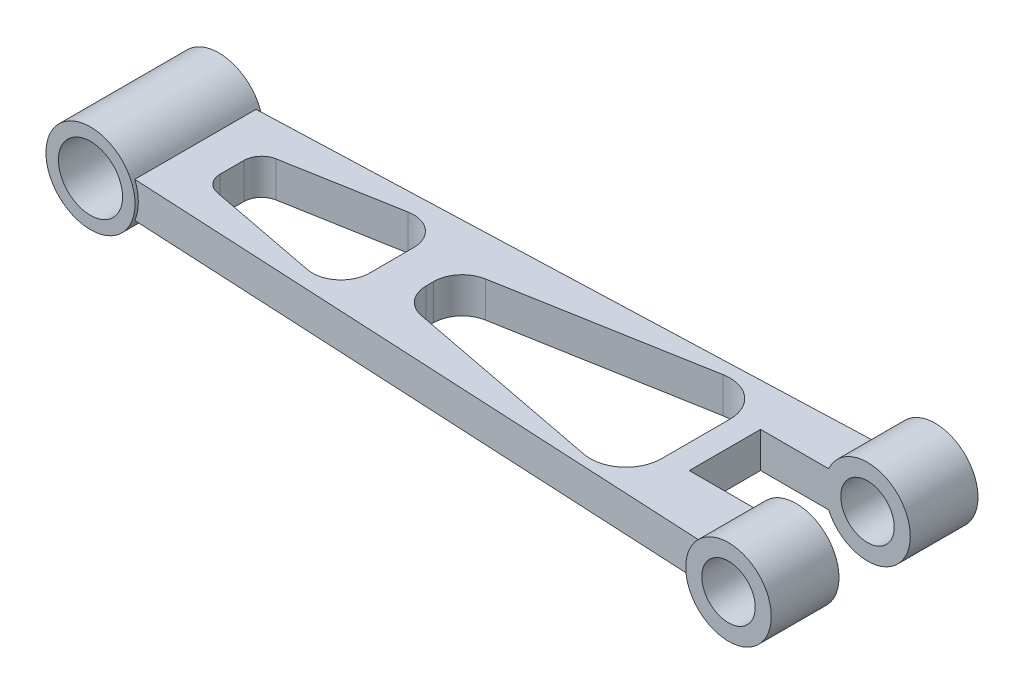
ISO-10303-21;
HEADER;
FILE_DESCRIPTION(('STEP AP214'),'2;1');
FILE_NAME('part.step','',(''),(''),'','','');
FILE_SCHEMA(('AUTOMOTIVE_DESIGN { 1 0 10303 214 1 1 1 1 }'));
ENDSEC;
DATA;
#1=APPLICATION_CONTEXT('core data for automotive mechanical design processes');
#2=APPLICATION_PROTOCOL_DEFINITION('international standard','automotive_design',2000,#1);
#3=PRODUCT_CONTEXT('',#1,'mechanical');
#4=PRODUCT('Part','Part','',(#3));
#5=PRODUCT_RELATED_PRODUCT_CATEGORY('part','',(#4));
#6=PRODUCT_DEFINITION_FORMATION('','',#4);
#7=PRODUCT_DEFINITION_CONTEXT('part definition',#1,'design');
#8=PRODUCT_DEFINITION('design','',#6,#7);
#9=PRODUCT_DEFINITION_SHAPE('','',#8);
#10=(LENGTH_UNIT() NAMED_UNIT(*) SI_UNIT(.MILLI.,.METRE.));
#11=(NAMED_UNIT(*) PLANE_ANGLE_UNIT() SI_UNIT($,.RADIAN.));
#12=(NAMED_UNIT(*) SI_UNIT($,.STERADIAN.) SOLID_ANGLE_UNIT());
#13=UNCERTAINTY_MEASURE_WITH_UNIT(LENGTH_MEASURE(1.E-05),#10,'distance_accuracy_value','');
#14=(GEOMETRIC_REPRESENTATION_CONTEXT(3) GLOBAL_UNCERTAINTY_ASSIGNED_CONTEXT((#13)) GLOBAL_UNIT_ASSIGNED_CONTEXT((#10,
#11,#12)) REPRESENTATION_CONTEXT('',''));
#15=CARTESIAN_POINT('',(0.,0.,0.));
#16=DIRECTION('',(0.,0.,1.));
#17=DIRECTION('',(1.,0.,0.));
#18=AXIS2_PLACEMENT_3D('',#15,#16,#17);
#19=CARTESIAN_POINT('',(95.,0.,29.));
#20=DIRECTION('',(0.,0.,-1.));
#21=DIRECTION('',(-1.,0.,0.));
#22=AXIS2_PLACEMENT_3D('',#19,#20,#21);
#23=CYLINDRICAL_SURFACE('',#22,12.);
#24=CARTESIAN_POINT('',(95.,0.,-29.));
#25=DIRECTION('',(0.,0.,1.));
#26=DIRECTION('',(1.,0.,0.));
#27=AXIS2_PLACEMENT_3D('',#24,#25,#26);
#28=CIRCLE('',#27,12.);
#29=CARTESIAN_POINT('',(107.,0.,-29.));
#30=VERTEX_POINT('',#29);
#31=EDGE_CURVE('E405',#30,#30,#28,.T.);
#32=ORIENTED_EDGE('',*,*,#31,.T.);
#33=EDGE_LOOP('',(#32));
#34=FACE_BOUND('',#33,.T.);
#35=CARTESIAN_POINT('',(95.,0.,-10.));
#36=DIRECTION('',(0.,0.,-1.));
#37=DIRECTION('',(-1.,0.,0.));
#38=AXIS2_PLACEMENT_3D('',#35,#36,#37);
#39=CIRCLE('',#38,12.);
#40=CARTESIAN_POINT('',(84.0912878853643,4.99999999999997,-10.));
#41=VERTEX_POINT('',#40);
#42=CARTESIAN_POINT('',(84.0912878853643,-5.,-10.));
#43=VERTEX_POINT('',#42);
#44=EDGE_CURVE('E360',#41,#43,#39,.T.);
#45=ORIENTED_EDGE('',*,*,#44,.T.);
#46=DIRECTION('',(0.,0.,-1.));
#47=VECTOR('',#46,1.);
#48=CARTESIAN_POINT('',(84.0912878853643,-5.,29.));
#49=LINE('',#48,#47);
#50=CARTESIAN_POINT('',(84.0912878853641,-5.,-23.1181290139471));
#51=VERTEX_POINT('',#50);
#52=EDGE_CURVE('E414',#43,#51,#49,.T.);
#53=ORIENTED_EDGE('',*,*,#52,.T.);
#54=CARTESIAN_POINT('',(95.,0.,-23.5170631291061));
#55=DIRECTION('',(0.0365458006997303,0.,0.999331979099646));
#56=DIRECTION('',(0.999331979099646,0.,-0.0365458006997303));
#57=AXIS2_PLACEMENT_3D('',#54,#55,#56);
#58=ELLIPSE('',#57,12.008021609407,12.);
#59=CARTESIAN_POINT('',(84.0912878853641,5.,-23.1181290139471));
#60=VERTEX_POINT('',#59);
#61=EDGE_CURVE('E409',#60,#51,#58,.T.);
#62=ORIENTED_EDGE('',*,*,#61,.F.);
#63=DIRECTION('',(0.,0.,-1.));
#64=VECTOR('',#63,1.);
#65=CARTESIAN_POINT('',(84.0912878853643,5.,29.));
#66=LINE('',#65,#64);
#67=EDGE_CURVE('E418',#41,#60,#66,.T.);
#68=ORIENTED_EDGE('',*,*,#67,.F.);
#69=EDGE_LOOP('',(#45,#53,#62,#68));
#70=FACE_BOUND('',#69,.T.);
#71=ADVANCED_FACE('F36',(#34,#70),#23,.T.);
#72=CARTESIAN_POINT('',(95.,0.,-29.));
#73=DIRECTION('',(0.,0.,1.));
#74=DIRECTION('',(1.,0.,0.));
#75=AXIS2_PLACEMENT_3D('',#72,#73,#74);
#76=CYLINDRICAL_SURFACE('',#75,7.50000000000001);
#77=CARTESIAN_POINT('',(95.,0.,-10.));
#78=DIRECTION('',(0.,0.,-1.));
#79=DIRECTION('',(-1.,0.,0.));
#80=AXIS2_PLACEMENT_3D('',#77,#78,#79);
#81=CIRCLE('',#80,7.50000000000001);
#82=CARTESIAN_POINT('',(87.5,0.,-10.));
#83=VERTEX_POINT('',#82);
#84=EDGE_CURVE('E356',#83,#83,#81,.F.);
#85=ORIENTED_EDGE('',*,*,#84,.T.);
#86=EDGE_LOOP('',(#85));
#87=FACE_BOUND('',#86,.T.);
#88=CARTESIAN_POINT('',(95.,0.,-29.));
#89=DIRECTION('',(0.,0.,1.));
#90=DIRECTION('',(1.,0.,0.));
#91=AXIS2_PLACEMENT_3D('',#88,#89,#90);
#92=CIRCLE('',#91,7.50000000000001);
#93=CARTESIAN_POINT('',(102.5,0.,-29.));
#94=VERTEX_POINT('',#93);
#95=EDGE_CURVE('E368',#94,#94,#92,.T.);
#96=ORIENTED_EDGE('',*,*,#95,.F.);
#97=EDGE_LOOP('',(#96));
#98=FACE_BOUND('',#97,.T.);
#99=ADVANCED_FACE('F471',(#87,#98),#76,.F.);
#100=CARTESIAN_POINT('',(95.,0.,29.));
#101=DIRECTION('',(0.,0.,1.));
#102=DIRECTION('',(1.,0.,0.));
#103=AXIS2_PLACEMENT_3D('',#100,#101,#102);
#104=CIRCLE('',#103,12.);
#105=CARTESIAN_POINT('',(107.,0.,29.));
#106=VERTEX_POINT('',#105);
#107=EDGE_CURVE('E406',#106,#106,#104,.T.);
#108=ORIENTED_EDGE('',*,*,#107,.F.);
#109=EDGE_LOOP('',(#108));
#110=FACE_BOUND('',#109,.T.);
#111=CARTESIAN_POINT('',(84.0912878853643,-5.,25.560781871242));
#112=VERTEX_POINT('',#111);
#113=CARTESIAN_POINT('',(84.0912878853643,-5.,10.));
#114=VERTEX_POINT('',#113);
#115=EDGE_CURVE('E415',#112,#114,#49,.T.);
#116=ORIENTED_EDGE('',*,*,#115,.T.);
#117=CARTESIAN_POINT('',(95.,0.,10.));
#118=DIRECTION('',(0.,0.,1.));
#119=DIRECTION('',(1.,0.,0.));
#120=AXIS2_PLACEMENT_3D('',#117,#118,#119);
#121=CIRCLE('',#120,12.);
#122=CARTESIAN_POINT('',(84.0912878853643,4.99999999999997,10.));
#123=VERTEX_POINT('',#122);
#124=EDGE_CURVE('E350',#114,#123,#121,.T.);
#125=ORIENTED_EDGE('',*,*,#124,.T.);
#126=CARTESIAN_POINT('',(84.0912878853643,5.,25.560781871242));
#127=VERTEX_POINT('',#126);
#128=EDGE_CURVE('E419',#127,#123,#66,.T.);
#129=ORIENTED_EDGE('',*,*,#128,.F.);
#130=CARTESIAN_POINT('',(95.,0.,26.1162363997815));
#131=DIRECTION('',(0.050852553448772,0.,-0.998706171908304));
#132=DIRECTION('',(-0.998706171908304,0.,-0.050852553448772));
#133=AXIS2_PLACEMENT_3D('',#130,#131,#132);
#134=ELLIPSE('',#133,12.0155460510179,12.);
#135=EDGE_CURVE('E422',#112,#127,#134,.T.);
#136=ORIENTED_EDGE('',*,*,#135,.F.);
#137=EDGE_LOOP('',(#116,#125,#129,#136));
#138=FACE_BOUND('',#137,.T.);
#139=ADVANCED_FACE('F474',(#110,#138),#23,.T.);
#140=CARTESIAN_POINT('',(95.,0.,29.));
#141=DIRECTION('',(0.,0.,1.));
#142=DIRECTION('',(1.,0.,0.));
#143=AXIS2_PLACEMENT_3D('',#140,#141,#142);
#144=PLANE('',#143);
#145=CARTESIAN_POINT('',(95.,0.,29.));
#146=DIRECTION('',(0.,0.,1.));
#147=DIRECTION('',(1.,0.,0.));
#148=AXIS2_PLACEMENT_3D('',#145,#146,#147);
#149=CIRCLE('',#148,7.50000000000001);
#150=CARTESIAN_POINT('',(102.5,0.,29.));
#151=VERTEX_POINT('',#150);
#152=EDGE_CURVE('E369',#151,#151,#149,.T.);
#153=ORIENTED_EDGE('',*,*,#152,.F.);
#154=EDGE_LOOP('',(#153));
#155=FACE_BOUND('',#154,.T.);
#156=ORIENTED_EDGE('',*,*,#107,.T.);
#157=EDGE_LOOP('',(#156));
#158=FACE_BOUND('',#157,.T.);
#159=ADVANCED_FACE('F484',(#155,#158),#144,.T.);
#160=CARTESIAN_POINT('',(95.,0.,-29.));
#161=DIRECTION('',(0.,0.,1.));
#162=DIRECTION('',(1.,0.,0.));
#163=AXIS2_PLACEMENT_3D('',#160,#161,#162);
#164=PLANE('',#163);
#165=ORIENTED_EDGE('',*,*,#95,.T.);
#166=EDGE_LOOP('',(#165));
#167=FACE_BOUND('',#166,.T.);
#168=ORIENTED_EDGE('',*,*,#31,.F.);
#169=EDGE_LOOP('',(#168));
#170=FACE_BOUND('',#169,.T.);
#171=ADVANCED_FACE('F38',(#167,#170),#164,.F.);
#172=CARTESIAN_POINT('',(0.,5.,0.));
#173=DIRECTION('',(0.,-1.,0.));
#174=DIRECTION('',(0.,0.,-1.));
#175=AXIS2_PLACEMENT_3D('',#172,#173,#174);
#176=PLANE('',#175);
#177=DIRECTION('',(-0.98190952454072,0.,-0.189350694786728));
#178=VECTOR('',#177,1.);
#179=CARTESIAN_POINT('',(-4.08125302438401,5.,21.1640164363641));
#180=LINE('',#179,#178);
#181=CARTESIAN_POINT('',(-37.3431881630948,4.99999999999999,14.7498098612605));
#182=VERTEX_POINT('',#181);
#183=CARTESIAN_POINT('',(-68.7751360787345,5.,8.6884966469799));
#184=VERTEX_POINT('',#183);
#185=EDGE_CURVE('E323',#182,#184,#180,.T.);
#186=ORIENTED_EDGE('',*,*,#185,.T.);
#187=CARTESIAN_POINT('',(-67.8283826048009,5.,3.77894902427629));
#188=DIRECTION('',(0.,-1.,0.));
#189=DIRECTION('',(0.,0.,-1.));
#190=AXIS2_PLACEMENT_3D('',#187,#188,#189);
#191=CIRCLE('',#190,5.);
#192=CARTESIAN_POINT('',(-72.8283826048009,4.99999999999999,3.77894902427626));
#193=VERTEX_POINT('',#192);
#194=EDGE_CURVE('E338',#184,#193,#191,.T.);
#195=ORIENTED_EDGE('',*,*,#194,.T.);
#196=DIRECTION('',(0.,0.,-1.));
#197=VECTOR('',#196,1.);
#198=CARTESIAN_POINT('',(-72.8283826048009,5.,0.));
#199=LINE('',#198,#197);
#200=CARTESIAN_POINT('',(-72.8283826048009,4.99999999999999,-2.84166329151157));
#201=VERTEX_POINT('',#200);
#202=EDGE_CURVE('E336',#193,#201,#199,.T.);
#203=ORIENTED_EDGE('',*,*,#202,.T.);
#204=CARTESIAN_POINT('',(-67.8283826048009,5.,-2.8416632915116));
#205=DIRECTION('',(0.,-1.,0.));
#206=DIRECTION('',(0.,0.,-1.));
#207=AXIS2_PLACEMENT_3D('',#204,#205,#206);
#208=CIRCLE('',#207,5.);
#209=CARTESIAN_POINT('',(-68.7047339542978,4.99999999999999,-7.76426507433284));
#210=VERTEX_POINT('',#209);
#211=EDGE_CURVE('E254',#201,#210,#208,.T.);
#212=ORIENTED_EDGE('',*,*,#211,.T.);
#213=DIRECTION('',(0.984520356564248,0.,-0.175270269899394));
#214=VECTOR('',#213,1.);
#215=CARTESIAN_POINT('',(-3.45036602580996,5.,-19.3812424203914));
#216=LINE('',#215,#214);
#217=CARTESIAN_POINT('',(-37.2305447639961,4.99999999999999,-13.3674906424664));
#218=VERTEX_POINT('',#217);
#219=EDGE_CURVE('E333',#210,#218,#216,.T.);
#220=ORIENTED_EDGE('',*,*,#219,.T.);
#221=CARTESIAN_POINT('',(-35.8283826048009,5.,-5.49132778995243));
#222=DIRECTION('',(0.,-1.,0.));
#223=DIRECTION('',(0.,0.,-1.));
#224=AXIS2_PLACEMENT_3D('',#221,#222,#223);
#225=CIRCLE('',#224,8.);
#226=CARTESIAN_POINT('',(-27.8283826048009,4.99999999999999,-5.49132778995236));
#227=VERTEX_POINT('',#226);
#228=EDGE_CURVE('E271',#218,#227,#225,.T.);
#229=ORIENTED_EDGE('',*,*,#228,.T.);
#230=DIRECTION('',(0.,0.,1.));
#231=VECTOR('',#230,1.);
#232=CARTESIAN_POINT('',(-27.8283826048009,5.,0.));
#233=LINE('',#232,#231);
#234=CARTESIAN_POINT('',(-27.8283826048009,4.99999999999999,6.89453366493466));
#235=VERTEX_POINT('',#234);
#236=EDGE_CURVE('E329',#227,#235,#233,.T.);
#237=ORIENTED_EDGE('',*,*,#236,.T.);
#238=CARTESIAN_POINT('',(-35.8283826048009,5.,6.89453366493473));
#239=DIRECTION('',(0.,-1.,0.));
#240=DIRECTION('',(0.,0.,-1.));
#241=AXIS2_PLACEMENT_3D('',#238,#239,#240);
#242=CIRCLE('',#241,8.);
#243=EDGE_CURVE('E326',#235,#182,#242,.T.);
#244=ORIENTED_EDGE('',*,*,#243,.T.);
#245=EDGE_LOOP('',(#186,#195,#203,#212,#220,#229,#237,#244));
#246=FACE_BOUND('',#245,.T.);
#247=DIRECTION('',(-0.98190952454072,0.,-0.189350694786728));
#248=VECTOR('',#247,1.);
#249=CARTESIAN_POINT('',(-2.21110408526903,5.,11.4660480307291));
#250=LINE('',#249,#248);
#251=CARTESIAN_POINT('',(46.3294695483435,4.99999999999999,20.8265757709708));
#252=VERTEX_POINT('',#251);
#253=CARTESIAN_POINT('',(-10.291829062083,5.,9.90776709903547));
#254=VERTEX_POINT('',#253);
#255=EDGE_CURVE('E302',#252,#254,#250,.T.);
#256=ORIENTED_EDGE('',*,*,#255,.T.);
#257=CARTESIAN_POINT('',(-8.77702350378922,5.,2.05249090270971));
#258=DIRECTION('',(0.,-1.,0.));
#259=DIRECTION('',(0.,0.,-1.));
#260=AXIS2_PLACEMENT_3D('',#257,#258,#259);
#261=CIRCLE('',#260,8.);
#262=CARTESIAN_POINT('',(-16.7770235037892,4.99999999999999,2.05249090270971));
#263=VERTEX_POINT('',#262);
#264=EDGE_CURVE('E211',#254,#263,#261,.T.);
#265=ORIENTED_EDGE('',*,*,#264,.T.);
#266=DIRECTION('',(0.,0.,-1.));
#267=VECTOR('',#266,1.);
#268=CARTESIAN_POINT('',(-16.7770235037892,5.,0.));
#269=LINE('',#268,#267);
#270=CARTESIAN_POINT('',(-16.7770235037892,4.99999999999999,-0.0800242868247675));
#271=VERTEX_POINT('',#270);
#272=EDGE_CURVE('E319',#263,#271,#269,.T.);
#273=ORIENTED_EDGE('',*,*,#272,.T.);
#274=CARTESIAN_POINT('',(-8.77702350378922,5.,-0.0800242868247685));
#275=DIRECTION('',(0.,-1.,0.));
#276=DIRECTION('',(0.,0.,-1.));
#277=AXIS2_PLACEMENT_3D('',#274,#275,#276);
#278=CIRCLE('',#277,8.);
#279=CARTESIAN_POINT('',(-10.1791856629844,4.99999999999999,-7.95618713933875));
#280=VERTEX_POINT('',#279);
#281=EDGE_CURVE('E316',#271,#280,#278,.T.);
#282=ORIENTED_EDGE('',*,*,#281,.T.);
#283=DIRECTION('',(0.984520356564248,0.,-0.175270269899394));
#284=VECTOR('',#283,1.);
#285=CARTESIAN_POINT('',(-1.68559816571888,5.,-9.46826696900827));
#286=LINE('',#285,#284);
#287=CARTESIAN_POINT('',(46.4702737972168,4.99999999999999,-18.0412666230115));
#288=VERTEX_POINT('',#287);
#289=EDGE_CURVE('E313',#280,#288,#286,.T.);
#290=ORIENTED_EDGE('',*,*,#289,.T.);
#291=CARTESIAN_POINT('',(48.2229764962108,5.,-8.19606305736897));
#292=DIRECTION('',(0.,-1.,0.));
#293=DIRECTION('',(0.,0.,-1.));
#294=AXIS2_PLACEMENT_3D('',#291,#292,#293);
#295=CIRCLE('',#294,10.);
#296=CARTESIAN_POINT('',(58.2229764962108,4.99999999999999,-8.19606305736897));
#297=VERTEX_POINT('',#296);
#298=EDGE_CURVE('E310',#288,#297,#295,.T.);
#299=ORIENTED_EDGE('',*,*,#298,.T.);
#300=DIRECTION('',(0.,0.,1.));
#301=VECTOR('',#300,1.);
#302=CARTESIAN_POINT('',(58.2229764962108,5.,0.));
#303=LINE('',#302,#301);
#304=CARTESIAN_POINT('',(58.2229764962108,4.99999999999999,11.0074805255636));
#305=VERTEX_POINT('',#304);
#306=EDGE_CURVE('E307',#297,#305,#303,.T.);
#307=ORIENTED_EDGE('',*,*,#306,.T.);
#308=CARTESIAN_POINT('',(48.2229764962108,5.,11.0074805255636));
#309=DIRECTION('',(0.,-1.,0.));
#310=DIRECTION('',(0.,0.,-1.));
#311=AXIS2_PLACEMENT_3D('',#308,#309,#310);
#312=CIRCLE('',#311,10.);
#313=EDGE_CURVE('E304',#305,#252,#312,.T.);
#314=ORIENTED_EDGE('',*,*,#313,.T.);
#315=EDGE_LOOP('',(#256,#265,#273,#282,#290,#299,#307,#314));
#316=FACE_BOUND('',#315,.T.);
#317=DIRECTION('',(0.,0.,-1.));
#318=VECTOR('',#317,1.);
#319=CARTESIAN_POINT('',(65.,5.,0.));
#320=LINE('',#319,#318);
#321=CARTESIAN_POINT('',(65.,4.99999999999999,10.));
#322=VERTEX_POINT('',#321);
#323=CARTESIAN_POINT('',(65.,4.99999999999999,-10.));
#324=VERTEX_POINT('',#323);
#325=EDGE_CURVE('E365',#322,#324,#320,.T.);
#326=ORIENTED_EDGE('',*,*,#325,.T.);
#327=DIRECTION('',(1.,0.,0.));
#328=VECTOR('',#327,1.);
#329=CARTESIAN_POINT('',(0.,5.,-10.));
#330=LINE('',#329,#328);
#331=EDGE_CURVE('E362',#324,#41,#330,.T.);
#332=ORIENTED_EDGE('',*,*,#331,.T.);
#333=ORIENTED_EDGE('',*,*,#67,.T.);
#334=DIRECTION('',(-0.999331979099646,0.,0.0365458006997303));
#335=VECTOR('',#334,1.);
#336=CARTESIAN_POINT('',(-86.,5.,-16.8978514306966));
#337=LINE('',#336,#335);
#338=CARTESIAN_POINT('',(-83.5435607626104,5.,-16.9876839795173));
#339=VERTEX_POINT('',#338);
#340=EDGE_CURVE('E382',#60,#339,#337,.T.);
#341=ORIENTED_EDGE('',*,*,#340,.T.);
#342=DIRECTION('',(0.,0.,-1.));
#343=VECTOR('',#342,1.);
#344=CARTESIAN_POINT('',(-83.5435607626104,5.,18.));
#345=LINE('',#344,#343);
#346=CARTESIAN_POINT('',(-83.5435607626104,5.,17.0250780370911));
#347=VERTEX_POINT('',#346);
#348=EDGE_CURVE('E403',#339,#347,#345,.F.);
#349=ORIENTED_EDGE('',*,*,#348,.T.);
#350=DIRECTION('',(0.998706171908304,0.,0.0508525534487719));
#351=VECTOR('',#350,1.);
#352=CARTESIAN_POINT('',(87.5,5.,25.7343481511717));
#353=LINE('',#352,#351);
#354=EDGE_CURVE('E379',#347,#127,#353,.T.);
#355=ORIENTED_EDGE('',*,*,#354,.T.);
#356=ORIENTED_EDGE('',*,*,#128,.T.);
#357=DIRECTION('',(-1.,0.,0.));
#358=VECTOR('',#357,1.);
#359=CARTESIAN_POINT('',(0.,5.,10.));
#360=LINE('',#359,#358);
#361=EDGE_CURVE('E353',#123,#322,#360,.T.);
#362=ORIENTED_EDGE('',*,*,#361,.T.);
#363=EDGE_LOOP('',(#326,#332,#333,#341,#349,#355,#356,#362));
#364=FACE_BOUND('',#363,.T.);
#365=ADVANCED_FACE('F455',(#246,#316,#364),#176,.F.);
#366=CARTESIAN_POINT('',(0.,-5.,0.));
#367=DIRECTION('',(0.,-1.,0.));
#368=DIRECTION('',(0.,0.,-1.));
#369=AXIS2_PLACEMENT_3D('',#366,#367,#368);
#370=PLANE('',#369);
#371=CARTESIAN_POINT('',(-67.8283826048009,-5.,3.77894902427629));
#372=DIRECTION('',(0.,-1.,0.));
#373=DIRECTION('',(0.,0.,-1.));
#374=AXIS2_PLACEMENT_3D('',#371,#372,#373);
#375=CIRCLE('',#374,5.);
#376=CARTESIAN_POINT('',(-68.7751360787345,-5.00000000000001,8.6884966469799));
#377=VERTEX_POINT('',#376);
#378=CARTESIAN_POINT('',(-72.8283826048009,-5.00000000000001,3.77894902427626));
#379=VERTEX_POINT('',#378);
#380=EDGE_CURVE('E11',#377,#379,#375,.T.);
#381=ORIENTED_EDGE('',*,*,#380,.F.);
#382=DIRECTION('',(-0.98190952454072,0.,-0.189350694786728));
#383=VECTOR('',#382,1.);
#384=CARTESIAN_POINT('',(-4.08125302438401,-5.,21.1640164363641));
#385=LINE('',#384,#383);
#386=CARTESIAN_POINT('',(-37.3431881630948,-5.,14.7498098612605));
#387=VERTEX_POINT('',#386);
#388=EDGE_CURVE('E219',#387,#377,#385,.T.);
#389=ORIENTED_EDGE('',*,*,#388,.F.);
#390=CARTESIAN_POINT('',(-35.8283826048009,-5.,6.89453366493473));
#391=DIRECTION('',(0.,-1.,0.));
#392=DIRECTION('',(0.,0.,-1.));
#393=AXIS2_PLACEMENT_3D('',#390,#391,#392);
#394=CIRCLE('',#393,8.);
#395=CARTESIAN_POINT('',(-27.8283826048009,-5.00000000000001,6.89453366493466));
#396=VERTEX_POINT('',#395);
#397=EDGE_CURVE('E221',#396,#387,#394,.T.);
#398=ORIENTED_EDGE('',*,*,#397,.F.);
#399=DIRECTION('',(0.,0.,1.));
#400=VECTOR('',#399,1.);
#401=CARTESIAN_POINT('',(-27.8283826048009,-5.,0.));
#402=LINE('',#401,#400);
#403=CARTESIAN_POINT('',(-27.8283826048009,-5.00000000000001,-5.49132778995236));
#404=VERTEX_POINT('',#403);
#405=EDGE_CURVE('E229',#404,#396,#402,.T.);
#406=ORIENTED_EDGE('',*,*,#405,.F.);
#407=CARTESIAN_POINT('',(-35.8283826048009,-5.,-5.49132778995243));
#408=DIRECTION('',(0.,-1.,0.));
#409=DIRECTION('',(0.,0.,-1.));
#410=AXIS2_PLACEMENT_3D('',#407,#408,#409);
#411=CIRCLE('',#410,8.);
#412=CARTESIAN_POINT('',(-37.2305447639961,-5.00000000000001,-13.3674906424664));
#413=VERTEX_POINT('',#412);
#414=EDGE_CURVE('E231',#413,#404,#411,.T.);
#415=ORIENTED_EDGE('',*,*,#414,.F.);
#416=DIRECTION('',(0.984520356564248,0.,-0.175270269899394));
#417=VECTOR('',#416,1.);
#418=CARTESIAN_POINT('',(-3.45036602580996,-5.,-19.3812424203914));
#419=LINE('',#418,#417);
#420=CARTESIAN_POINT('',(-68.7047339542978,-5.00000000000001,-7.76426507433284));
#421=VERTEX_POINT('',#420);
#422=EDGE_CURVE('E233',#421,#413,#419,.T.);
#423=ORIENTED_EDGE('',*,*,#422,.F.);
#424=CARTESIAN_POINT('',(-67.8283826048009,-5.,-2.8416632915116));
#425=DIRECTION('',(0.,-1.,0.));
#426=DIRECTION('',(0.,0.,-1.));
#427=AXIS2_PLACEMENT_3D('',#424,#425,#426);
#428=CIRCLE('',#427,5.);
#429=CARTESIAN_POINT('',(-72.8283826048009,-5.00000000000001,-2.84166329151157));
#430=VERTEX_POINT('',#429);
#431=EDGE_CURVE('E235',#430,#421,#428,.T.);
#432=ORIENTED_EDGE('',*,*,#431,.F.);
#433=DIRECTION('',(0.,0.,-1.));
#434=VECTOR('',#433,1.);
#435=CARTESIAN_POINT('',(-72.8283826048009,-5.,0.));
#436=LINE('',#435,#434);
#437=EDGE_CURVE('E44',#379,#430,#436,.T.);
#438=ORIENTED_EDGE('',*,*,#437,.F.);
#439=EDGE_LOOP('',(#381,#389,#398,#406,#415,#423,#432,#438));
#440=FACE_BOUND('',#439,.T.);
#441=CARTESIAN_POINT('',(-8.77702350378922,-5.,2.05249090270971));
#442=DIRECTION('',(0.,-1.,0.));
#443=DIRECTION('',(0.,0.,-1.));
#444=AXIS2_PLACEMENT_3D('',#441,#442,#443);
#445=CIRCLE('',#444,8.);
#446=CARTESIAN_POINT('',(-10.291829062083,-5.00000000000001,9.90776709903547));
#447=VERTEX_POINT('',#446);
#448=CARTESIAN_POINT('',(-16.7770235037892,-5.00000000000001,2.05249090270971));
#449=VERTEX_POINT('',#448);
#450=EDGE_CURVE('E208',#447,#449,#445,.T.);
#451=ORIENTED_EDGE('',*,*,#450,.F.);
#452=DIRECTION('',(-0.98190952454072,0.,-0.189350694786728));
#453=VECTOR('',#452,1.);
#454=CARTESIAN_POINT('',(-2.21110408526903,-5.,11.4660480307291));
#455=LINE('',#454,#453);
#456=CARTESIAN_POINT('',(46.3294695483435,-5.,20.8265757709708));
#457=VERTEX_POINT('',#456);
#458=EDGE_CURVE('E194',#457,#447,#455,.T.);
#459=ORIENTED_EDGE('',*,*,#458,.F.);
#460=CARTESIAN_POINT('',(48.2229764962108,-5.,11.0074805255636));
#461=DIRECTION('',(0.,-1.,0.));
#462=DIRECTION('',(0.,0.,-1.));
#463=AXIS2_PLACEMENT_3D('',#460,#461,#462);
#464=CIRCLE('',#463,10.);
#465=CARTESIAN_POINT('',(58.2229764962108,-5.00000000000001,11.0074805255636));
#466=VERTEX_POINT('',#465);
#467=EDGE_CURVE('E202',#466,#457,#464,.T.);
#468=ORIENTED_EDGE('',*,*,#467,.F.);
#469=DIRECTION('',(0.,0.,1.));
#470=VECTOR('',#469,1.);
#471=CARTESIAN_POINT('',(58.2229764962108,-5.,0.));
#472=LINE('',#471,#470);
#473=CARTESIAN_POINT('',(58.2229764962108,-5.00000000000001,-8.19606305736897));
#474=VERTEX_POINT('',#473);
#475=EDGE_CURVE('E433',#474,#466,#472,.T.);
#476=ORIENTED_EDGE('',*,*,#475,.F.);
#477=CARTESIAN_POINT('',(48.2229764962108,-5.,-8.19606305736897));
#478=DIRECTION('',(0.,-1.,0.));
#479=DIRECTION('',(0.,0.,-1.));
#480=AXIS2_PLACEMENT_3D('',#477,#478,#479);
#481=CIRCLE('',#480,10.);
#482=CARTESIAN_POINT('',(46.4702737972168,-5.00000000000001,-18.0412666230115));
#483=VERTEX_POINT('',#482);
#484=EDGE_CURVE('E435',#483,#474,#481,.T.);
#485=ORIENTED_EDGE('',*,*,#484,.F.);
#486=DIRECTION('',(0.984520356564248,0.,-0.175270269899394));
#487=VECTOR('',#486,1.);
#488=CARTESIAN_POINT('',(-1.68559816571888,-5.,-9.46826696900827));
#489=LINE('',#488,#487);
#490=CARTESIAN_POINT('',(-10.1791856629844,-5.00000000000001,-7.95618713933875));
#491=VERTEX_POINT('',#490);
#492=EDGE_CURVE('E437',#491,#483,#489,.T.);
#493=ORIENTED_EDGE('',*,*,#492,.F.);
#494=CARTESIAN_POINT('',(-8.77702350378922,-5.,-0.0800242868247685));
#495=DIRECTION('',(0.,-1.,0.));
#496=DIRECTION('',(0.,0.,-1.));
#497=AXIS2_PLACEMENT_3D('',#494,#495,#496);
#498=CIRCLE('',#497,8.);
#499=CARTESIAN_POINT('',(-16.7770235037892,-5.00000000000001,-0.0800242868247675));
#500=VERTEX_POINT('',#499);
#501=EDGE_CURVE('E223',#500,#491,#498,.T.);
#502=ORIENTED_EDGE('',*,*,#501,.F.);
#503=DIRECTION('',(0.,0.,-1.));
#504=VECTOR('',#503,1.);
#505=CARTESIAN_POINT('',(-16.7770235037892,-5.,0.));
#506=LINE('',#505,#504);
#507=EDGE_CURVE('E218',#449,#500,#506,.T.);
#508=ORIENTED_EDGE('',*,*,#507,.F.);
#509=EDGE_LOOP('',(#451,#459,#468,#476,#485,#493,#502,#508));
#510=FACE_BOUND('',#509,.T.);
#511=DIRECTION('',(1.,0.,0.));
#512=VECTOR('',#511,1.);
#513=CARTESIAN_POINT('',(0.,-5.,-10.));
#514=LINE('',#513,#512);
#515=CARTESIAN_POINT('',(65.,-5.00000000000001,-10.));
#516=VERTEX_POINT('',#515);
#517=EDGE_CURVE('E357',#516,#43,#514,.T.);
#518=ORIENTED_EDGE('',*,*,#517,.F.);
#519=DIRECTION('',(0.,0.,-1.));
#520=VECTOR('',#519,1.);
#521=CARTESIAN_POINT('',(65.,-5.,0.));
#522=LINE('',#521,#520);
#523=CARTESIAN_POINT('',(65.,-5.00000000000001,10.));
#524=VERTEX_POINT('',#523);
#525=EDGE_CURVE('E203',#524,#516,#522,.T.);
#526=ORIENTED_EDGE('',*,*,#525,.F.);
#527=DIRECTION('',(-1.,0.,0.));
#528=VECTOR('',#527,1.);
#529=CARTESIAN_POINT('',(0.,-5.,10.));
#530=LINE('',#529,#528);
#531=EDGE_CURVE('E348',#114,#524,#530,.T.);
#532=ORIENTED_EDGE('',*,*,#531,.F.);
#533=ORIENTED_EDGE('',*,*,#115,.F.);
#534=DIRECTION('',(0.998706171908304,0.,0.0508525534487719));
#535=VECTOR('',#534,1.);
#536=CARTESIAN_POINT('',(87.5,-5.,25.7343481511717));
#537=LINE('',#536,#535);
#538=CARTESIAN_POINT('',(-83.5435607626104,-5.,17.0250780370911));
#539=VERTEX_POINT('',#538);
#540=EDGE_CURVE('E378',#539,#112,#537,.T.);
#541=ORIENTED_EDGE('',*,*,#540,.F.);
#542=DIRECTION('',(0.,0.,-1.));
#543=VECTOR('',#542,1.);
#544=CARTESIAN_POINT('',(-83.5435607626104,-5.,18.));
#545=LINE('',#544,#543);
#546=CARTESIAN_POINT('',(-83.5435607626104,-5.,-16.9876839795173));
#547=VERTEX_POINT('',#546);
#548=EDGE_CURVE('E392',#547,#539,#545,.F.);
#549=ORIENTED_EDGE('',*,*,#548,.F.);
#550=DIRECTION('',(-0.999331979099646,0.,0.0365458006997303));
#551=VECTOR('',#550,1.);
#552=CARTESIAN_POINT('',(-86.,-5.,-16.8978514306966));
#553=LINE('',#552,#551);
#554=EDGE_CURVE('E383',#51,#547,#553,.T.);
#555=ORIENTED_EDGE('',*,*,#554,.F.);
#556=ORIENTED_EDGE('',*,*,#52,.F.);
#557=EDGE_LOOP('',(#518,#526,#532,#533,#541,#549,#555,#556));
#558=FACE_BOUND('',#557,.T.);
#559=ADVANCED_FACE('F215',(#440,#510,#558),#370,.T.);
#560=CARTESIAN_POINT('',(-95.,0.,18.));
#561=DIRECTION('',(0.,0.,-1.));
#562=DIRECTION('',(-1.,0.,0.));
#563=AXIS2_PLACEMENT_3D('',#560,#561,#562);
#564=CYLINDRICAL_SURFACE('',#563,12.5);
#565=CARTESIAN_POINT('',(-95.,0.,-18.));
#566=DIRECTION('',(0.,0.,1.));
#567=DIRECTION('',(1.,0.,0.));
#568=AXIS2_PLACEMENT_3D('',#565,#566,#567);
#569=CIRCLE('',#568,12.5);
#570=CARTESIAN_POINT('',(-82.5,0.,-18.));
#571=VERTEX_POINT('',#570);
#572=EDGE_CURVE('E385',#571,#571,#569,.T.);
#573=ORIENTED_EDGE('',*,*,#572,.T.);
#574=EDGE_LOOP('',(#573));
#575=FACE_BOUND('',#574,.T.);
#576=CARTESIAN_POINT('',(-95.,0.,18.));
#577=DIRECTION('',(0.,0.,1.));
#578=DIRECTION('',(1.,0.,0.));
#579=AXIS2_PLACEMENT_3D('',#576,#577,#578);
#580=CIRCLE('',#579,12.5);
#581=CARTESIAN_POINT('',(-82.5,0.,18.));
#582=VERTEX_POINT('',#581);
#583=EDGE_CURVE('E389',#582,#582,#580,.T.);
#584=ORIENTED_EDGE('',*,*,#583,.F.);
#585=EDGE_LOOP('',(#584));
#586=FACE_BOUND('',#585,.T.);
#587=ORIENTED_EDGE('',*,*,#348,.F.);
#588=CARTESIAN_POINT('',(-95.,0.,-16.568719357295));
#589=DIRECTION('',(0.0365458006997303,0.,0.999331979099646));
#590=DIRECTION('',(0.999331979099646,0.,-0.0365458006997303));
#591=AXIS2_PLACEMENT_3D('',#588,#589,#590);
#592=ELLIPSE('',#591,12.5083558431323,12.5);
#593=EDGE_CURVE('E397',#547,#339,#592,.T.);
#594=ORIENTED_EDGE('',*,*,#593,.F.);
#595=ORIENTED_EDGE('',*,*,#548,.T.);
#596=CARTESIAN_POINT('',(-95.,0.,16.4417341016683));
#597=DIRECTION('',(0.050852553448772,0.,-0.998706171908304));
#598=DIRECTION('',(-0.998706171908304,0.,-0.050852553448772));
#599=AXIS2_PLACEMENT_3D('',#596,#597,#598);
#600=ELLIPSE('',#599,12.5161938031436,12.5);
#601=EDGE_CURVE('E400',#347,#539,#600,.T.);
#602=ORIENTED_EDGE('',*,*,#601,.F.);
#603=EDGE_LOOP('',(#587,#594,#595,#602));
#604=FACE_BOUND('',#603,.T.);
#605=ADVANCED_FACE('F504',(#575,#586,#604),#564,.T.);
#606=CARTESIAN_POINT('',(-95.,0.,18.));
#607=DIRECTION('',(0.,0.,1.));
#608=DIRECTION('',(1.,0.,0.));
#609=AXIS2_PLACEMENT_3D('',#606,#607,#608);
#610=PLANE('',#609);
#611=CARTESIAN_POINT('',(-95.,0.,18.));
#612=DIRECTION('',(0.,0.,1.));
#613=DIRECTION('',(1.,0.,0.));
#614=AXIS2_PLACEMENT_3D('',#611,#612,#613);
#615=CIRCLE('',#614,9.);
#616=CARTESIAN_POINT('',(-86.,0.,18.));
#617=VERTEX_POINT('',#616);
#618=EDGE_CURVE('E375',#617,#617,#615,.T.);
#619=ORIENTED_EDGE('',*,*,#618,.F.);
#620=EDGE_LOOP('',(#619));
#621=FACE_BOUND('',#620,.T.);
#622=ORIENTED_EDGE('',*,*,#583,.T.);
#623=EDGE_LOOP('',(#622));
#624=FACE_BOUND('',#623,.T.);
#625=ADVANCED_FACE('F539',(#621,#624),#610,.T.);
#626=CARTESIAN_POINT('',(-95.,0.,-18.));
#627=DIRECTION('',(0.,0.,1.));
#628=DIRECTION('',(1.,0.,0.));
#629=AXIS2_PLACEMENT_3D('',#626,#627,#628);
#630=PLANE('',#629);
#631=CARTESIAN_POINT('',(-95.,0.,-18.));
#632=DIRECTION('',(0.,0.,1.));
#633=DIRECTION('',(1.,0.,0.));
#634=AXIS2_PLACEMENT_3D('',#631,#632,#633);
#635=CIRCLE('',#634,9.);
#636=CARTESIAN_POINT('',(-86.,0.,-18.));
#637=VERTEX_POINT('',#636);
#638=EDGE_CURVE('E372',#637,#637,#635,.T.);
#639=ORIENTED_EDGE('',*,*,#638,.T.);
#640=EDGE_LOOP('',(#639));
#641=FACE_BOUND('',#640,.T.);
#642=ORIENTED_EDGE('',*,*,#572,.F.);
#643=EDGE_LOOP('',(#642));
#644=FACE_BOUND('',#643,.T.);
#645=ADVANCED_FACE('F536',(#641,#644),#630,.F.);
#646=CARTESIAN_POINT('',(87.5,5.,25.7343481511717));
#647=DIRECTION('',(0.050852553448772,0.,-0.998706171908304));
#648=DIRECTION('',(-0.998706171908304,0.,-0.050852553448772));
#649=AXIS2_PLACEMENT_3D('',#646,#647,#648);
#650=PLANE('',#649);
#651=ORIENTED_EDGE('',*,*,#540,.T.);
#652=ORIENTED_EDGE('',*,*,#135,.T.);
#653=ORIENTED_EDGE('',*,*,#354,.F.);
#654=ORIENTED_EDGE('',*,*,#601,.T.);
#655=EDGE_LOOP('',(#651,#652,#653,#654));
#656=FACE_BOUND('',#655,.T.);
#657=ADVANCED_FACE('F498',(#656),#650,.F.);
#658=CARTESIAN_POINT('',(-86.,5.,-16.8978514306966));
#659=DIRECTION('',(0.0365458006997303,0.,0.999331979099646));
#660=DIRECTION('',(0.999331979099646,0.,-0.0365458006997303));
#661=AXIS2_PLACEMENT_3D('',#658,#659,#660);
#662=PLANE('',#661);
#663=ORIENTED_EDGE('',*,*,#340,.F.);
#664=ORIENTED_EDGE('',*,*,#61,.T.);
#665=ORIENTED_EDGE('',*,*,#554,.T.);
#666=ORIENTED_EDGE('',*,*,#593,.T.);
#667=EDGE_LOOP('',(#663,#664,#665,#666));
#668=FACE_BOUND('',#667,.T.);
#669=ADVANCED_FACE('F509',(#668),#662,.F.);
#670=CARTESIAN_POINT('',(-95.,0.,-29.));
#671=DIRECTION('',(0.,0.,1.));
#672=DIRECTION('',(1.,0.,0.));
#673=AXIS2_PLACEMENT_3D('',#670,#671,#672);
#674=CYLINDRICAL_SURFACE('',#673,9.);
#675=ORIENTED_EDGE('',*,*,#618,.T.);
#676=EDGE_LOOP('',(#675));
#677=FACE_BOUND('',#676,.T.);
#678=ORIENTED_EDGE('',*,*,#638,.F.);
#679=EDGE_LOOP('',(#678));
#680=FACE_BOUND('',#679,.T.);
#681=ADVANCED_FACE('F533',(#677,#680),#674,.F.);
#682=CARTESIAN_POINT('',(95.,0.,9.99999999999999));
#683=DIRECTION('',(0.,0.,1.));
#684=DIRECTION('',(1.,0.,0.));
#685=AXIS2_PLACEMENT_3D('',#682,#683,#684);
#686=CIRCLE('',#685,7.50000000000001);
#687=CARTESIAN_POINT('',(102.5,0.,9.99999999999999));
#688=VERTEX_POINT('',#687);
#689=EDGE_CURVE('E345',#688,#688,#686,.F.);
#690=ORIENTED_EDGE('',*,*,#689,.T.);
#691=EDGE_LOOP('',(#690));
#692=FACE_BOUND('',#691,.T.);
#693=ORIENTED_EDGE('',*,*,#152,.T.);
#694=EDGE_LOOP('',(#693));
#695=FACE_BOUND('',#694,.T.);
#696=ADVANCED_FACE('F480',(#692,#695),#76,.F.);
#697=CARTESIAN_POINT('',(65.,-24.,-10.));
#698=DIRECTION('',(-1.,0.,0.));
#699=DIRECTION('',(0.,0.,1.));
#700=AXIS2_PLACEMENT_3D('',#697,#698,#699);
#701=PLANE('',#700);
#702=DIRECTION('',(0.,1.,0.));
#703=VECTOR('',#702,1.);
#704=CARTESIAN_POINT('',(65.,-24.,10.));
#705=LINE('',#704,#703);
#706=EDGE_CURVE('E341',#524,#322,#705,.T.);
#707=ORIENTED_EDGE('',*,*,#706,.F.);
#708=ORIENTED_EDGE('',*,*,#525,.T.);
#709=DIRECTION('',(0.,1.,0.));
#710=VECTOR('',#709,1.);
#711=CARTESIAN_POINT('',(65.,-24.,-10.));
#712=LINE('',#711,#710);
#713=EDGE_CURVE('E342',#516,#324,#712,.T.);
#714=ORIENTED_EDGE('',*,*,#713,.T.);
#715=ORIENTED_EDGE('',*,*,#325,.F.);
#716=EDGE_LOOP('',(#707,#708,#714,#715));
#717=FACE_BOUND('',#716,.T.);
#718=ADVANCED_FACE('F517',(#717),#701,.F.);
#719=CARTESIAN_POINT('',(65.,-24.,-10.));
#720=DIRECTION('',(0.,0.,-1.));
#721=DIRECTION('',(-1.,0.,0.));
#722=AXIS2_PLACEMENT_3D('',#719,#720,#721);
#723=PLANE('',#722);
#724=ORIENTED_EDGE('',*,*,#84,.F.);
#725=EDGE_LOOP('',(#724));
#726=FACE_BOUND('',#725,.T.);
#727=ORIENTED_EDGE('',*,*,#713,.F.);
#728=ORIENTED_EDGE('',*,*,#517,.T.);
#729=ORIENTED_EDGE('',*,*,#44,.F.);
#730=ORIENTED_EDGE('',*,*,#331,.F.);
#731=EDGE_LOOP('',(#727,#728,#729,#730));
#732=FACE_BOUND('',#731,.T.);
#733=ADVANCED_FACE('F514',(#726,#732),#723,.F.);
#734=CARTESIAN_POINT('',(65.,-24.,10.));
#735=DIRECTION('',(0.,0.,1.));
#736=DIRECTION('',(1.,0.,0.));
#737=AXIS2_PLACEMENT_3D('',#734,#735,#736);
#738=PLANE('',#737);
#739=ORIENTED_EDGE('',*,*,#689,.F.);
#740=EDGE_LOOP('',(#739));
#741=FACE_BOUND('',#740,.T.);
#742=ORIENTED_EDGE('',*,*,#124,.F.);
#743=ORIENTED_EDGE('',*,*,#531,.T.);
#744=ORIENTED_EDGE('',*,*,#706,.T.);
#745=ORIENTED_EDGE('',*,*,#361,.F.);
#746=EDGE_LOOP('',(#742,#743,#744,#745));
#747=FACE_BOUND('',#746,.T.);
#748=ADVANCED_FACE('F519',(#741,#747),#738,.F.);
#749=CARTESIAN_POINT('',(-8.77702350378922,-24.,2.05249090270971));
#750=DIRECTION('',(0.,1.,0.));
#751=DIRECTION('',(0.,0.,1.));
#752=AXIS2_PLACEMENT_3D('',#749,#750,#751);
#753=CYLINDRICAL_SURFACE('',#752,8.);
#754=DIRECTION('',(0.,1.,0.));
#755=VECTOR('',#754,1.);
#756=CARTESIAN_POINT('',(-10.291829062083,-24.,9.90776709903547));
#757=LINE('',#756,#755);
#758=EDGE_CURVE('E59',#447,#254,#757,.T.);
#759=ORIENTED_EDGE('',*,*,#758,.F.);
#760=ORIENTED_EDGE('',*,*,#450,.T.);
#761=DIRECTION('',(0.,1.,0.));
#762=VECTOR('',#761,1.);
#763=CARTESIAN_POINT('',(-16.7770235037892,-24.,2.05249090270971));
#764=LINE('',#763,#762);
#765=EDGE_CURVE('E300',#449,#263,#764,.T.);
#766=ORIENTED_EDGE('',*,*,#765,.T.);
#767=ORIENTED_EDGE('',*,*,#264,.F.);
#768=EDGE_LOOP('',(#759,#760,#766,#767));
#769=FACE_BOUND('',#768,.T.);
#770=ADVANCED_FACE('F206',(#769),#753,.F.);
#771=CARTESIAN_POINT('',(-16.7770235037892,-24.,-0.0800242868247675));
#772=DIRECTION('',(-1.,0.,0.));
#773=DIRECTION('',(0.,0.,1.));
#774=AXIS2_PLACEMENT_3D('',#771,#772,#773);
#775=PLANE('',#774);
#776=ORIENTED_EDGE('',*,*,#765,.F.);
#777=ORIENTED_EDGE('',*,*,#507,.T.);
#778=DIRECTION('',(0.,1.,0.));
#779=VECTOR('',#778,1.);
#780=CARTESIAN_POINT('',(-16.7770235037892,-24.,-0.0800242868247675));
#781=LINE('',#780,#779);
#782=EDGE_CURVE('E297',#500,#271,#781,.T.);
#783=ORIENTED_EDGE('',*,*,#782,.T.);
#784=ORIENTED_EDGE('',*,*,#272,.F.);
#785=EDGE_LOOP('',(#776,#777,#783,#784));
#786=FACE_BOUND('',#785,.T.);
#787=ADVANCED_FACE('F458',(#786),#775,.F.);
#788=CARTESIAN_POINT('',(-8.77702350378922,-24.,-0.0800242868247685));
#789=DIRECTION('',(0.,1.,0.));
#790=DIRECTION('',(0.,0.,1.));
#791=AXIS2_PLACEMENT_3D('',#788,#789,#790);
#792=CYLINDRICAL_SURFACE('',#791,8.);
#793=ORIENTED_EDGE('',*,*,#782,.F.);
#794=ORIENTED_EDGE('',*,*,#501,.T.);
#795=DIRECTION('',(0.,1.,0.));
#796=VECTOR('',#795,1.);
#797=CARTESIAN_POINT('',(-10.1791856629844,-24.,-7.95618713933875));
#798=LINE('',#797,#796);
#799=EDGE_CURVE('E294',#491,#280,#798,.T.);
#800=ORIENTED_EDGE('',*,*,#799,.T.);
#801=ORIENTED_EDGE('',*,*,#281,.F.);
#802=EDGE_LOOP('',(#793,#794,#800,#801));
#803=FACE_BOUND('',#802,.T.);
#804=ADVANCED_FACE('F441',(#803),#792,.F.);
#805=CARTESIAN_POINT('',(46.4702737972168,-24.,-18.0412666230115));
#806=DIRECTION('',(-0.175270269899394,0.,-0.984520356564248));
#807=DIRECTION('',(-0.984520356564248,0.,0.175270269899394));
#808=AXIS2_PLACEMENT_3D('',#805,#806,#807);
#809=PLANE('',#808);
#810=ORIENTED_EDGE('',*,*,#799,.F.);
#811=ORIENTED_EDGE('',*,*,#492,.T.);
#812=DIRECTION('',(0.,1.,0.));
#813=VECTOR('',#812,1.);
#814=CARTESIAN_POINT('',(46.4702737972168,-24.,-18.0412666230115));
#815=LINE('',#814,#813);
#816=EDGE_CURVE('E291',#483,#288,#815,.T.);
#817=ORIENTED_EDGE('',*,*,#816,.T.);
#818=ORIENTED_EDGE('',*,*,#289,.F.);
#819=EDGE_LOOP('',(#810,#811,#817,#818));
#820=FACE_BOUND('',#819,.T.);
#821=ADVANCED_FACE('F444',(#820),#809,.F.);
#822=CARTESIAN_POINT('',(48.2229764962108,-24.,-8.19606305736897));
#823=DIRECTION('',(0.,1.,0.));
#824=DIRECTION('',(0.,0.,1.));
#825=AXIS2_PLACEMENT_3D('',#822,#823,#824);
#826=CYLINDRICAL_SURFACE('',#825,10.);
#827=ORIENTED_EDGE('',*,*,#816,.F.);
#828=ORIENTED_EDGE('',*,*,#484,.T.);
#829=DIRECTION('',(0.,1.,0.));
#830=VECTOR('',#829,1.);
#831=CARTESIAN_POINT('',(58.2229764962108,-24.,-8.19606305736897));
#832=LINE('',#831,#830);
#833=EDGE_CURVE('E288',#474,#297,#832,.T.);
#834=ORIENTED_EDGE('',*,*,#833,.T.);
#835=ORIENTED_EDGE('',*,*,#298,.F.);
#836=EDGE_LOOP('',(#827,#828,#834,#835));
#837=FACE_BOUND('',#836,.T.);
#838=ADVANCED_FACE('F450',(#837),#826,.F.);
#839=CARTESIAN_POINT('',(58.2229764962108,-24.,11.0074805255636));
#840=DIRECTION('',(1.,0.,0.));
#841=DIRECTION('',(0.,0.,-1.));
#842=AXIS2_PLACEMENT_3D('',#839,#840,#841);
#843=PLANE('',#842);
#844=ORIENTED_EDGE('',*,*,#833,.F.);
#845=ORIENTED_EDGE('',*,*,#475,.T.);
#846=DIRECTION('',(0.,1.,0.));
#847=VECTOR('',#846,1.);
#848=CARTESIAN_POINT('',(58.2229764962108,-24.,11.0074805255636));
#849=LINE('',#848,#847);
#850=EDGE_CURVE('E285',#466,#305,#849,.T.);
#851=ORIENTED_EDGE('',*,*,#850,.T.);
#852=ORIENTED_EDGE('',*,*,#306,.F.);
#853=EDGE_LOOP('',(#844,#845,#851,#852));
#854=FACE_BOUND('',#853,.T.);
#855=ADVANCED_FACE('F452',(#854),#843,.F.);
#856=CARTESIAN_POINT('',(48.2229764962108,-24.,11.0074805255636));
#857=DIRECTION('',(0.,1.,0.));
#858=DIRECTION('',(0.,0.,1.));
#859=AXIS2_PLACEMENT_3D('',#856,#857,#858);
#860=CYLINDRICAL_SURFACE('',#859,10.);
#861=ORIENTED_EDGE('',*,*,#850,.F.);
#862=ORIENTED_EDGE('',*,*,#467,.T.);
#863=DIRECTION('',(0.,1.,0.));
#864=VECTOR('',#863,1.);
#865=CARTESIAN_POINT('',(46.3294695483435,-24.,20.8265757709708));
#866=LINE('',#865,#864);
#867=EDGE_CURVE('E197',#457,#252,#866,.T.);
#868=ORIENTED_EDGE('',*,*,#867,.T.);
#869=ORIENTED_EDGE('',*,*,#313,.F.);
#870=EDGE_LOOP('',(#861,#862,#868,#869));
#871=FACE_BOUND('',#870,.T.);
#872=ADVANCED_FACE('F460',(#871),#860,.F.);
#873=CARTESIAN_POINT('',(-10.291829062083,-24.,9.90776709903547));
#874=DIRECTION('',(-0.189350694786728,0.,0.98190952454072));
#875=DIRECTION('',(0.98190952454072,0.,0.189350694786728));
#876=AXIS2_PLACEMENT_3D('',#873,#874,#875);
#877=PLANE('',#876);
#878=ORIENTED_EDGE('',*,*,#867,.F.);
#879=ORIENTED_EDGE('',*,*,#458,.T.);
#880=ORIENTED_EDGE('',*,*,#758,.T.);
#881=ORIENTED_EDGE('',*,*,#255,.F.);
#882=EDGE_LOOP('',(#878,#879,#880,#881));
#883=FACE_BOUND('',#882,.T.);
#884=ADVANCED_FACE('F195',(#883),#877,.F.);
#885=CARTESIAN_POINT('',(-67.8283826048009,-24.,3.77894902427629));
#886=DIRECTION('',(0.,1.,0.));
#887=DIRECTION('',(0.,0.,1.));
#888=AXIS2_PLACEMENT_3D('',#885,#886,#887);
#889=CYLINDRICAL_SURFACE('',#888,5.);
#890=DIRECTION('',(0.,1.,0.));
#891=VECTOR('',#890,1.);
#892=CARTESIAN_POINT('',(-68.7751360787345,-24.,8.6884966469799));
#893=LINE('',#892,#891);
#894=EDGE_CURVE('E51',#377,#184,#893,.T.);
#895=ORIENTED_EDGE('',*,*,#894,.F.);
#896=ORIENTED_EDGE('',*,*,#380,.T.);
#897=DIRECTION('',(0.,1.,0.));
#898=VECTOR('',#897,1.);
#899=CARTESIAN_POINT('',(-72.8283826048009,-24.,3.77894902427626));
#900=LINE('',#899,#898);
#901=EDGE_CURVE('E245',#379,#193,#900,.T.);
#902=ORIENTED_EDGE('',*,*,#901,.T.);
#903=ORIENTED_EDGE('',*,*,#194,.F.);
#904=EDGE_LOOP('',(#895,#896,#902,#903));
#905=FACE_BOUND('',#904,.T.);
#906=ADVANCED_FACE('F467',(#905),#889,.F.);
#907=CARTESIAN_POINT('',(-72.8283826048009,-24.,-2.84166329151157));
#908=DIRECTION('',(-1.,0.,0.));
#909=DIRECTION('',(0.,0.,1.));
#910=AXIS2_PLACEMENT_3D('',#907,#908,#909);
#911=PLANE('',#910);
#912=ORIENTED_EDGE('',*,*,#901,.F.);
#913=ORIENTED_EDGE('',*,*,#437,.T.);
#914=DIRECTION('',(0.,1.,0.));
#915=VECTOR('',#914,1.);
#916=CARTESIAN_POINT('',(-72.8283826048009,-24.,-2.84166329151157));
#917=LINE('',#916,#915);
#918=EDGE_CURVE('E242',#430,#201,#917,.T.);
#919=ORIENTED_EDGE('',*,*,#918,.T.);
#920=ORIENTED_EDGE('',*,*,#202,.F.);
#921=EDGE_LOOP('',(#912,#913,#919,#920));
#922=FACE_BOUND('',#921,.T.);
#923=ADVANCED_FACE('F241',(#922),#911,.F.);
#924=CARTESIAN_POINT('',(-67.8283826048009,-24.,-2.8416632915116));
#925=DIRECTION('',(0.,1.,0.));
#926=DIRECTION('',(0.,0.,1.));
#927=AXIS2_PLACEMENT_3D('',#924,#925,#926);
#928=CYLINDRICAL_SURFACE('',#927,5.);
#929=ORIENTED_EDGE('',*,*,#918,.F.);
#930=ORIENTED_EDGE('',*,*,#431,.T.);
#931=DIRECTION('',(0.,1.,0.));
#932=VECTOR('',#931,1.);
#933=CARTESIAN_POINT('',(-68.7047339542978,-24.,-7.76426507433284));
#934=LINE('',#933,#932);
#935=EDGE_CURVE('E255',#421,#210,#934,.T.);
#936=ORIENTED_EDGE('',*,*,#935,.T.);
#937=ORIENTED_EDGE('',*,*,#211,.F.);
#938=EDGE_LOOP('',(#929,#930,#936,#937));
#939=FACE_BOUND('',#938,.T.);
#940=ADVANCED_FACE('F250',(#939),#928,.F.);
#941=CARTESIAN_POINT('',(-37.2305447639961,-24.,-13.3674906424664));
#942=DIRECTION('',(-0.175270269899394,0.,-0.984520356564248));
#943=DIRECTION('',(-0.984520356564248,0.,0.175270269899394));
#944=AXIS2_PLACEMENT_3D('',#941,#942,#943);
#945=PLANE('',#944);
#946=ORIENTED_EDGE('',*,*,#935,.F.);
#947=ORIENTED_EDGE('',*,*,#422,.T.);
#948=DIRECTION('',(0.,1.,0.));
#949=VECTOR('',#948,1.);
#950=CARTESIAN_POINT('',(-37.2305447639961,-24.,-13.3674906424664));
#951=LINE('',#950,#949);
#952=EDGE_CURVE('E264',#413,#218,#951,.T.);
#953=ORIENTED_EDGE('',*,*,#952,.T.);
#954=ORIENTED_EDGE('',*,*,#219,.F.);
#955=EDGE_LOOP('',(#946,#947,#953,#954));
#956=FACE_BOUND('',#955,.T.);
#957=ADVANCED_FACE('F263',(#956),#945,.F.);
#958=CARTESIAN_POINT('',(-35.8283826048009,-24.,-5.49132778995243));
#959=DIRECTION('',(0.,1.,0.));
#960=DIRECTION('',(0.,0.,1.));
#961=AXIS2_PLACEMENT_3D('',#958,#959,#960);
#962=CYLINDRICAL_SURFACE('',#961,8.);
#963=ORIENTED_EDGE('',*,*,#952,.F.);
#964=ORIENTED_EDGE('',*,*,#414,.T.);
#965=DIRECTION('',(0.,1.,0.));
#966=VECTOR('',#965,1.);
#967=CARTESIAN_POINT('',(-27.8283826048009,-24.,-5.49132778995236));
#968=LINE('',#967,#966);
#969=EDGE_CURVE('E272',#404,#227,#968,.T.);
#970=ORIENTED_EDGE('',*,*,#969,.T.);
#971=ORIENTED_EDGE('',*,*,#228,.F.);
#972=EDGE_LOOP('',(#963,#964,#970,#971));
#973=FACE_BOUND('',#972,.T.);
#974=ADVANCED_FACE('F267',(#973),#962,.F.);
#975=CARTESIAN_POINT('',(-27.8283826048009,-24.,6.89453366493466));
#976=DIRECTION('',(1.,0.,0.));
#977=DIRECTION('',(0.,0.,-1.));
#978=AXIS2_PLACEMENT_3D('',#975,#976,#977);
#979=PLANE('',#978);
#980=ORIENTED_EDGE('',*,*,#969,.F.);
#981=ORIENTED_EDGE('',*,*,#405,.T.);
#982=DIRECTION('',(0.,1.,0.));
#983=VECTOR('',#982,1.);
#984=CARTESIAN_POINT('',(-27.8283826048009,-24.,6.89453366493466));
#985=LINE('',#984,#983);
#986=EDGE_CURVE('E275',#396,#235,#985,.T.);
#987=ORIENTED_EDGE('',*,*,#986,.T.);
#988=ORIENTED_EDGE('',*,*,#236,.F.);
#989=EDGE_LOOP('',(#980,#981,#987,#988));
#990=FACE_BOUND('',#989,.T.);
#991=ADVANCED_FACE('F643',(#990),#979,.F.);
#992=CARTESIAN_POINT('',(-35.8283826048009,-24.,6.89453366493473));
#993=DIRECTION('',(0.,1.,0.));
#994=DIRECTION('',(0.,0.,1.));
#995=AXIS2_PLACEMENT_3D('',#992,#993,#994);
#996=CYLINDRICAL_SURFACE('',#995,8.);
#997=ORIENTED_EDGE('',*,*,#986,.F.);
#998=ORIENTED_EDGE('',*,*,#397,.T.);
#999=DIRECTION('',(0.,1.,0.));
#1000=VECTOR('',#999,1.);
#1001=CARTESIAN_POINT('',(-37.3431881630948,-24.,14.7498098612605));
#1002=LINE('',#1001,#1000);
#1003=EDGE_CURVE('E280',#387,#182,#1002,.T.);
#1004=ORIENTED_EDGE('',*,*,#1003,.T.);
#1005=ORIENTED_EDGE('',*,*,#243,.F.);
#1006=EDGE_LOOP('',(#997,#998,#1004,#1005));
#1007=FACE_BOUND('',#1006,.T.);
#1008=ADVANCED_FACE('F653',(#1007),#996,.F.);
#1009=CARTESIAN_POINT('',(-68.7751360787345,-24.,8.6884966469799));
#1010=DIRECTION('',(-0.189350694786728,0.,0.98190952454072));
#1011=DIRECTION('',(0.98190952454072,0.,0.189350694786728));
#1012=AXIS2_PLACEMENT_3D('',#1009,#1010,#1011);
#1013=PLANE('',#1012);
#1014=ORIENTED_EDGE('',*,*,#1003,.F.);
#1015=ORIENTED_EDGE('',*,*,#388,.T.);
#1016=ORIENTED_EDGE('',*,*,#894,.T.);
#1017=ORIENTED_EDGE('',*,*,#185,.F.);
#1018=EDGE_LOOP('',(#1014,#1015,#1016,#1017));
#1019=FACE_BOUND('',#1018,.T.);
#1020=ADVANCED_FACE('F664',(#1019),#1013,.F.);
#1021=CLOSED_SHELL('',(#71,#99,#139,#159,#171,#365,#559,#605,#625,#645,#657,#669,#681,#696,#718,
#733,#748,#770,#787,#804,#821,#838,#855,#872,#884,#906,#923,#940,#957,#974,#991,#1008,#1020));
#1022=MANIFOLD_SOLID_BREP('B2',#1021);
#1023=ADVANCED_BREP_SHAPE_REPRESENTATION('',(#18,#1022),#14);
#1024=SHAPE_DEFINITION_REPRESENTATION(#9,#1023);
ENDSEC;
END-ISO-10303-21;
